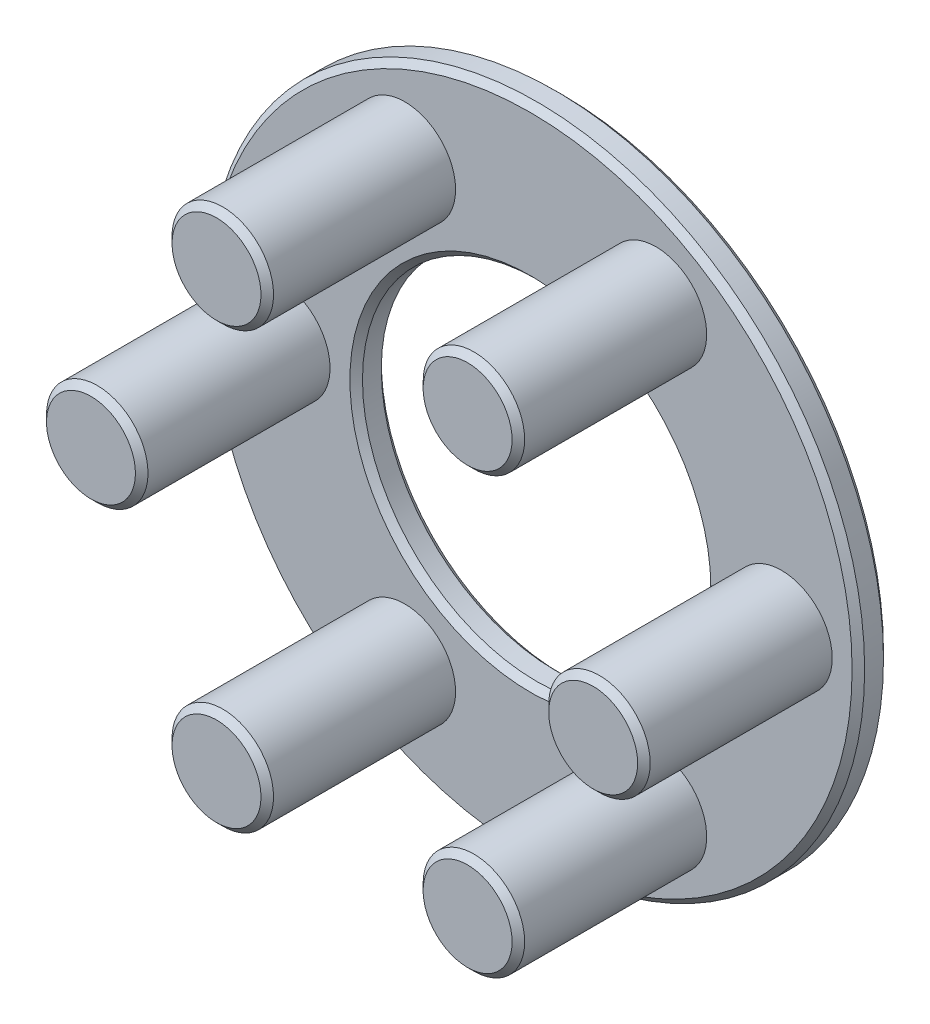
ISO-10303-21;
HEADER;
FILE_DESCRIPTION(('STEP AP214'),'2;1');
FILE_NAME('part.step','',(''),(''),'','','');
FILE_SCHEMA(('AUTOMOTIVE_DESIGN { 1 0 10303 214 1 1 1 1 }'));
ENDSEC;
DATA;
#1=APPLICATION_CONTEXT('core data for automotive mechanical design processes');
#2=APPLICATION_PROTOCOL_DEFINITION('international standard','automotive_design',2000,#1);
#3=PRODUCT_CONTEXT('',#1,'mechanical');
#4=PRODUCT('Part','Part','',(#3));
#5=PRODUCT_RELATED_PRODUCT_CATEGORY('part','',(#4));
#6=PRODUCT_DEFINITION_FORMATION('','',#4);
#7=PRODUCT_DEFINITION_CONTEXT('part definition',#1,'design');
#8=PRODUCT_DEFINITION('design','',#6,#7);
#9=PRODUCT_DEFINITION_SHAPE('','',#8);
#10=(LENGTH_UNIT() NAMED_UNIT(*) SI_UNIT(.MILLI.,.METRE.));
#11=(NAMED_UNIT(*) PLANE_ANGLE_UNIT() SI_UNIT($,.RADIAN.));
#12=(NAMED_UNIT(*) SI_UNIT($,.STERADIAN.) SOLID_ANGLE_UNIT());
#13=UNCERTAINTY_MEASURE_WITH_UNIT(LENGTH_MEASURE(1.E-05),#10,'distance_accuracy_value','');
#14=(GEOMETRIC_REPRESENTATION_CONTEXT(3) GLOBAL_UNCERTAINTY_ASSIGNED_CONTEXT((#13)) GLOBAL_UNIT_ASSIGNED_CONTEXT((#10,
#11,#12)) REPRESENTATION_CONTEXT('',''));
#15=CARTESIAN_POINT('',(0.,0.,0.));
#16=DIRECTION('',(0.,0.,1.));
#17=DIRECTION('',(1.,0.,0.));
#18=AXIS2_PLACEMENT_3D('',#15,#16,#17);
#19=CARTESIAN_POINT('',(0.,0.,-3.));
#20=DIRECTION('',(0.,0.,1.));
#21=DIRECTION('',(1.,0.,0.));
#22=AXIS2_PLACEMENT_3D('',#19,#20,#21);
#23=CYLINDRICAL_SURFACE('',#22,31.35);
#24=CARTESIAN_POINT('',(0.,0.,-2.39999999999999));
#25=DIRECTION('',(0.,0.,1.));
#26=DIRECTION('',(1.,0.,0.));
#27=AXIS2_PLACEMENT_3D('',#24,#25,#26);
#28=CIRCLE('',#27,31.35);
#29=CARTESIAN_POINT('',(31.35,0.,-2.39999999999999));
#30=VERTEX_POINT('',#29);
#31=EDGE_CURVE('E64',#30,#30,#28,.T.);
#32=ORIENTED_EDGE('',*,*,#31,.T.);
#33=EDGE_LOOP('',(#32));
#34=FACE_BOUND('',#33,.T.);
#35=CARTESIAN_POINT('',(0.,0.,-0.599999999999989));
#36=DIRECTION('',(0.,0.,1.));
#37=DIRECTION('',(1.,0.,0.));
#38=AXIS2_PLACEMENT_3D('',#35,#36,#37);
#39=CIRCLE('',#38,31.35);
#40=CARTESIAN_POINT('',(31.35,0.,-0.599999999999989));
#41=VERTEX_POINT('',#40);
#42=EDGE_CURVE('E67',#41,#41,#39,.F.);
#43=ORIENTED_EDGE('',*,*,#42,.T.);
#44=EDGE_LOOP('',(#43));
#45=FACE_BOUND('',#44,.T.);
#46=ADVANCED_FACE('F37',(#34,#45),#23,.T.);
#47=CARTESIAN_POINT('',(0.,0.,-3.));
#48=DIRECTION('',(0.,0.,1.));
#49=DIRECTION('',(1.,0.,0.));
#50=AXIS2_PLACEMENT_3D('',#47,#48,#49);
#51=PLANE('',#50);
#52=CARTESIAN_POINT('',(0.,0.,-3.));
#53=DIRECTION('',(0.,0.,1.));
#54=DIRECTION('',(1.,0.,0.));
#55=AXIS2_PLACEMENT_3D('',#52,#53,#54);
#56=CIRCLE('',#55,30.75);
#57=CARTESIAN_POINT('',(30.75,0.,-3.));
#58=VERTEX_POINT('',#57);
#59=EDGE_CURVE('E58',#58,#58,#56,.F.);
#60=ORIENTED_EDGE('',*,*,#59,.T.);
#61=EDGE_LOOP('',(#60));
#62=FACE_BOUND('',#61,.T.);
#63=CARTESIAN_POINT('',(0.,0.,-3.));
#64=DIRECTION('',(0.,0.,1.));
#65=DIRECTION('',(1.,0.,0.));
#66=AXIS2_PLACEMENT_3D('',#63,#64,#65);
#67=CIRCLE('',#66,17.25);
#68=CARTESIAN_POINT('',(17.25,0.,-3.));
#69=VERTEX_POINT('',#68);
#70=EDGE_CURVE('E61',#69,#69,#67,.T.);
#71=ORIENTED_EDGE('',*,*,#70,.T.);
#72=EDGE_LOOP('',(#71));
#73=FACE_BOUND('',#72,.T.);
#74=ADVANCED_FACE('F131',(#62,#73),#51,.F.);
#75=CARTESIAN_POINT('',(0.,0.,0.));
#76=DIRECTION('',(0.,0.,1.));
#77=DIRECTION('',(1.,0.,0.));
#78=AXIS2_PLACEMENT_3D('',#75,#76,#77);
#79=PLANE('',#78);
#80=CARTESIAN_POINT('',(0.,0.,0.));
#81=DIRECTION('',(0.,0.,1.));
#82=DIRECTION('',(1.,0.,0.));
#83=AXIS2_PLACEMENT_3D('',#80,#81,#82);
#84=CIRCLE('',#83,30.75);
#85=CARTESIAN_POINT('',(30.75,0.,0.));
#86=VERTEX_POINT('',#85);
#87=EDGE_CURVE('E49',#86,#86,#84,.T.);
#88=ORIENTED_EDGE('',*,*,#87,.T.);
#89=EDGE_LOOP('',(#88));
#90=FACE_BOUND('',#89,.T.);
#91=CARTESIAN_POINT('',(0.,0.,0.));
#92=DIRECTION('',(0.,0.,1.));
#93=DIRECTION('',(1.,0.,0.));
#94=AXIS2_PLACEMENT_3D('',#91,#92,#93);
#95=CIRCLE('',#94,17.25);
#96=CARTESIAN_POINT('',(17.25,0.,0.));
#97=VERTEX_POINT('',#96);
#98=EDGE_CURVE('E53',#97,#97,#95,.F.);
#99=ORIENTED_EDGE('',*,*,#98,.T.);
#100=EDGE_LOOP('',(#99));
#101=FACE_BOUND('',#100,.T.);
#102=CARTESIAN_POINT('',(12.0000000000002,20.7846096908264,0.));
#103=DIRECTION('',(0.,0.,1.));
#104=DIRECTION('',(0.50000000000001,0.866025403784433,0.));
#105=AXIS2_PLACEMENT_3D('',#102,#103,#104);
#106=CIRCLE('',#105,4.85);
#107=CARTESIAN_POINT('',(14.4250000000003,24.9848328991809,0.));
#108=VERTEX_POINT('',#107);
#109=EDGE_CURVE('E121',#108,#108,#106,.T.);
#110=ORIENTED_EDGE('',*,*,#109,.F.);
#111=EDGE_LOOP('',(#110));
#112=FACE_BOUND('',#111,.T.);
#113=CARTESIAN_POINT('',(-11.9999999999998,20.7846096908266,0.));
#114=DIRECTION('',(0.,0.,1.));
#115=DIRECTION('',(-0.499999999999992,0.866025403784443,0.));
#116=AXIS2_PLACEMENT_3D('',#113,#114,#115);
#117=CIRCLE('',#116,4.85);
#118=CARTESIAN_POINT('',(-14.4249999999998,24.9848328991812,0.));
#119=VERTEX_POINT('',#118);
#120=EDGE_CURVE('E118',#119,#119,#117,.T.);
#121=ORIENTED_EDGE('',*,*,#120,.F.);
#122=EDGE_LOOP('',(#121));
#123=FACE_BOUND('',#122,.T.);
#124=CARTESIAN_POINT('',(-24.,0.,0.));
#125=DIRECTION('',(0.,0.,1.));
#126=DIRECTION('',(-1.,0.,0.));
#127=AXIS2_PLACEMENT_3D('',#124,#125,#126);
#128=CIRCLE('',#127,4.85);
#129=CARTESIAN_POINT('',(-28.85,0.,0.));
#130=VERTEX_POINT('',#129);
#131=EDGE_CURVE('E115',#130,#130,#128,.T.);
#132=ORIENTED_EDGE('',*,*,#131,.F.);
#133=EDGE_LOOP('',(#132));
#134=FACE_BOUND('',#133,.T.);
#135=CARTESIAN_POINT('',(-12.0000000000001,-20.7846096908265,0.));
#136=DIRECTION('',(0.,0.,1.));
#137=DIRECTION('',(-0.500000000000004,-0.866025403784436,0.));
#138=AXIS2_PLACEMENT_3D('',#135,#136,#137);
#139=CIRCLE('',#138,4.85);
#140=CARTESIAN_POINT('',(-14.4250000000001,-24.984832899181,0.));
#141=VERTEX_POINT('',#140);
#142=EDGE_CURVE('E112',#141,#141,#139,.T.);
#143=ORIENTED_EDGE('',*,*,#142,.F.);
#144=EDGE_LOOP('',(#143));
#145=FACE_BOUND('',#144,.T.);
#146=CARTESIAN_POINT('',(12.,-20.7846096908266,0.));
#147=DIRECTION('',(0.,0.,1.));
#148=DIRECTION('',(0.499999999999998,-0.86602540378444,0.));
#149=AXIS2_PLACEMENT_3D('',#146,#147,#148);
#150=CIRCLE('',#149,4.85);
#151=CARTESIAN_POINT('',(14.4249999999999,-24.9848328991811,0.));
#152=VERTEX_POINT('',#151);
#153=EDGE_CURVE('E109',#152,#152,#150,.T.);
#154=ORIENTED_EDGE('',*,*,#153,.F.);
#155=EDGE_LOOP('',(#154));
#156=FACE_BOUND('',#155,.T.);
#157=CARTESIAN_POINT('',(24.,0.,0.));
#158=DIRECTION('',(0.,0.,1.));
#159=DIRECTION('',(1.,0.,0.));
#160=AXIS2_PLACEMENT_3D('',#157,#158,#159);
#161=CIRCLE('',#160,4.85);
#162=CARTESIAN_POINT('',(28.85,0.,0.));
#163=VERTEX_POINT('',#162);
#164=EDGE_CURVE('E106',#163,#163,#161,.T.);
#165=ORIENTED_EDGE('',*,*,#164,.F.);
#166=EDGE_LOOP('',(#165));
#167=FACE_BOUND('',#166,.T.);
#168=ADVANCED_FACE('F127',(#90,#101,#112,#123,#134,#145,#156,#167),#79,.T.);
#169=CARTESIAN_POINT('',(0.,0.,-3.));
#170=DIRECTION('',(0.,0.,1.));
#171=DIRECTION('',(1.,0.,0.));
#172=AXIS2_PLACEMENT_3D('',#169,#170,#171);
#173=CYLINDRICAL_SURFACE('',#172,16.65);
#174=CARTESIAN_POINT('',(0.,0.,-2.39999999999999));
#175=DIRECTION('',(0.,0.,1.));
#176=DIRECTION('',(1.,0.,0.));
#177=AXIS2_PLACEMENT_3D('',#174,#175,#176);
#178=CIRCLE('',#177,16.65);
#179=CARTESIAN_POINT('',(16.65,0.,-2.39999999999999));
#180=VERTEX_POINT('',#179);
#181=EDGE_CURVE('E10',#180,#180,#178,.F.);
#182=ORIENTED_EDGE('',*,*,#181,.T.);
#183=EDGE_LOOP('',(#182));
#184=FACE_BOUND('',#183,.T.);
#185=CARTESIAN_POINT('',(0.,0.,-0.599999999999993));
#186=DIRECTION('',(0.,0.,1.));
#187=DIRECTION('',(1.,0.,0.));
#188=AXIS2_PLACEMENT_3D('',#185,#186,#187);
#189=CIRCLE('',#188,16.65);
#190=CARTESIAN_POINT('',(16.65,0.,-0.599999999999993));
#191=VERTEX_POINT('',#190);
#192=EDGE_CURVE('E45',#191,#191,#189,.T.);
#193=ORIENTED_EDGE('',*,*,#192,.T.);
#194=EDGE_LOOP('',(#193));
#195=FACE_BOUND('',#194,.T.);
#196=ADVANCED_FACE('F130',(#184,#195),#173,.F.);
#197=CARTESIAN_POINT('',(24.,0.,18.));
#198=DIRECTION('',(0.,0.,-1.));
#199=DIRECTION('',(-1.,0.,0.));
#200=AXIS2_PLACEMENT_3D('',#197,#198,#199);
#201=CYLINDRICAL_SURFACE('',#200,4.85);
#202=CARTESIAN_POINT('',(24.,0.,17.4));
#203=DIRECTION('',(0.,0.,1.));
#204=DIRECTION('',(1.,0.,0.));
#205=AXIS2_PLACEMENT_3D('',#202,#203,#204);
#206=CIRCLE('',#205,4.85);
#207=CARTESIAN_POINT('',(28.85,0.,17.4));
#208=VERTEX_POINT('',#207);
#209=EDGE_CURVE('E88',#208,#208,#206,.F.);
#210=ORIENTED_EDGE('',*,*,#209,.T.);
#211=EDGE_LOOP('',(#210));
#212=FACE_BOUND('',#211,.T.);
#213=ORIENTED_EDGE('',*,*,#164,.T.);
#214=EDGE_LOOP('',(#213));
#215=FACE_BOUND('',#214,.T.);
#216=ADVANCED_FACE('F144',(#212,#215),#201,.T.);
#217=CARTESIAN_POINT('',(24.,0.,18.));
#218=DIRECTION('',(0.,0.,1.));
#219=DIRECTION('',(1.,0.,0.));
#220=AXIS2_PLACEMENT_3D('',#217,#218,#219);
#221=PLANE('',#220);
#222=CARTESIAN_POINT('',(24.,0.,18.));
#223=DIRECTION('',(0.,0.,1.));
#224=DIRECTION('',(1.,0.,0.));
#225=AXIS2_PLACEMENT_3D('',#222,#223,#224);
#226=CIRCLE('',#225,4.25);
#227=CARTESIAN_POINT('',(28.25,0.,18.));
#228=VERTEX_POINT('',#227);
#229=EDGE_CURVE('E91',#228,#228,#226,.T.);
#230=ORIENTED_EDGE('',*,*,#229,.T.);
#231=EDGE_LOOP('',(#230));
#232=FACE_BOUND('',#231,.T.);
#233=ADVANCED_FACE('F146',(#232),#221,.T.);
#234=CARTESIAN_POINT('',(12.,-20.7846096908266,18.));
#235=DIRECTION('',(0.,0.,-1.));
#236=DIRECTION('',(-1.,0.,0.));
#237=AXIS2_PLACEMENT_3D('',#234,#235,#236);
#238=CYLINDRICAL_SURFACE('',#237,4.85);
#239=CARTESIAN_POINT('',(12.,-20.7846096908266,17.4));
#240=DIRECTION('',(0.,0.,1.));
#241=DIRECTION('',(1.,0.,0.));
#242=AXIS2_PLACEMENT_3D('',#239,#240,#241);
#243=CIRCLE('',#242,4.85);
#244=CARTESIAN_POINT('',(16.8499999999999,-20.7846096908266,17.4));
#245=VERTEX_POINT('',#244);
#246=EDGE_CURVE('E94',#245,#245,#243,.F.);
#247=ORIENTED_EDGE('',*,*,#246,.T.);
#248=EDGE_LOOP('',(#247));
#249=FACE_BOUND('',#248,.T.);
#250=ORIENTED_EDGE('',*,*,#153,.T.);
#251=EDGE_LOOP('',(#250));
#252=FACE_BOUND('',#251,.T.);
#253=ADVANCED_FACE('F153',(#249,#252),#238,.T.);
#254=CARTESIAN_POINT('',(12.,-20.7846096908266,18.));
#255=DIRECTION('',(0.,0.,1.));
#256=DIRECTION('',(0.499999999999998,-0.86602540378444,0.));
#257=AXIS2_PLACEMENT_3D('',#254,#255,#256);
#258=PLANE('',#257);
#259=CARTESIAN_POINT('',(12.,-20.7846096908266,18.));
#260=DIRECTION('',(0.,0.,1.));
#261=DIRECTION('',(1.,0.,0.));
#262=AXIS2_PLACEMENT_3D('',#259,#260,#261);
#263=CIRCLE('',#262,4.25);
#264=CARTESIAN_POINT('',(16.25,-20.7846096908266,18.));
#265=VERTEX_POINT('',#264);
#266=EDGE_CURVE('E97',#265,#265,#263,.T.);
#267=ORIENTED_EDGE('',*,*,#266,.T.);
#268=EDGE_LOOP('',(#267));
#269=FACE_BOUND('',#268,.T.);
#270=ADVANCED_FACE('F388',(#269),#258,.T.);
#271=CARTESIAN_POINT('',(-12.0000000000001,-20.7846096908265,18.));
#272=DIRECTION('',(0.,0.,-1.));
#273=DIRECTION('',(-1.,0.,0.));
#274=AXIS2_PLACEMENT_3D('',#271,#272,#273);
#275=CYLINDRICAL_SURFACE('',#274,4.85);
#276=CARTESIAN_POINT('',(-12.0000000000001,-20.7846096908265,17.4));
#277=DIRECTION('',(0.,0.,1.));
#278=DIRECTION('',(1.,0.,0.));
#279=AXIS2_PLACEMENT_3D('',#276,#277,#278);
#280=CIRCLE('',#279,4.85);
#281=CARTESIAN_POINT('',(-7.1500000000001,-20.7846096908265,17.4));
#282=VERTEX_POINT('',#281);
#283=EDGE_CURVE('E100',#282,#282,#280,.F.);
#284=ORIENTED_EDGE('',*,*,#283,.T.);
#285=EDGE_LOOP('',(#284));
#286=FACE_BOUND('',#285,.T.);
#287=ORIENTED_EDGE('',*,*,#142,.T.);
#288=EDGE_LOOP('',(#287));
#289=FACE_BOUND('',#288,.T.);
#290=ADVANCED_FACE('F377',(#286,#289),#275,.T.);
#291=CARTESIAN_POINT('',(-12.0000000000001,-20.7846096908265,18.));
#292=DIRECTION('',(0.,0.,1.));
#293=DIRECTION('',(-0.500000000000004,-0.866025403784436,0.));
#294=AXIS2_PLACEMENT_3D('',#291,#292,#293);
#295=PLANE('',#294);
#296=CARTESIAN_POINT('',(-12.0000000000001,-20.7846096908265,18.));
#297=DIRECTION('',(0.,0.,1.));
#298=DIRECTION('',(1.,0.,0.));
#299=AXIS2_PLACEMENT_3D('',#296,#297,#298);
#300=CIRCLE('',#299,4.25000000000002);
#301=CARTESIAN_POINT('',(-7.75000000000008,-20.7846096908265,18.));
#302=VERTEX_POINT('',#301);
#303=EDGE_CURVE('E103',#302,#302,#300,.T.);
#304=ORIENTED_EDGE('',*,*,#303,.T.);
#305=EDGE_LOOP('',(#304));
#306=FACE_BOUND('',#305,.T.);
#307=ADVANCED_FACE('F366',(#306),#295,.T.);
#308=CARTESIAN_POINT('',(-24.,0.,18.));
#309=DIRECTION('',(0.,0.,-1.));
#310=DIRECTION('',(-1.,0.,0.));
#311=AXIS2_PLACEMENT_3D('',#308,#309,#310);
#312=CYLINDRICAL_SURFACE('',#311,4.85);
#313=CARTESIAN_POINT('',(-24.,0.,17.4));
#314=DIRECTION('',(0.,0.,1.));
#315=DIRECTION('',(1.,0.,0.));
#316=AXIS2_PLACEMENT_3D('',#313,#314,#315);
#317=CIRCLE('',#316,4.85);
#318=CARTESIAN_POINT('',(-19.15,0.,17.4));
#319=VERTEX_POINT('',#318);
#320=EDGE_CURVE('E76',#319,#319,#317,.F.);
#321=ORIENTED_EDGE('',*,*,#320,.T.);
#322=EDGE_LOOP('',(#321));
#323=FACE_BOUND('',#322,.T.);
#324=ORIENTED_EDGE('',*,*,#131,.T.);
#325=EDGE_LOOP('',(#324));
#326=FACE_BOUND('',#325,.T.);
#327=ADVANCED_FACE('F355',(#323,#326),#312,.T.);
#328=CARTESIAN_POINT('',(-24.,0.,18.));
#329=DIRECTION('',(0.,0.,1.));
#330=DIRECTION('',(-1.,0.,0.));
#331=AXIS2_PLACEMENT_3D('',#328,#329,#330);
#332=PLANE('',#331);
#333=CARTESIAN_POINT('',(-24.,0.,18.));
#334=DIRECTION('',(0.,0.,1.));
#335=DIRECTION('',(1.,0.,0.));
#336=AXIS2_PLACEMENT_3D('',#333,#334,#335);
#337=CIRCLE('',#336,4.25);
#338=CARTESIAN_POINT('',(-19.75,0.,18.));
#339=VERTEX_POINT('',#338);
#340=EDGE_CURVE('E79',#339,#339,#337,.T.);
#341=ORIENTED_EDGE('',*,*,#340,.T.);
#342=EDGE_LOOP('',(#341));
#343=FACE_BOUND('',#342,.T.);
#344=ADVANCED_FACE('F344',(#343),#332,.T.);
#345=CARTESIAN_POINT('',(-11.9999999999998,20.7846096908266,18.));
#346=DIRECTION('',(0.,0.,-1.));
#347=DIRECTION('',(-1.,0.,0.));
#348=AXIS2_PLACEMENT_3D('',#345,#346,#347);
#349=CYLINDRICAL_SURFACE('',#348,4.85);
#350=CARTESIAN_POINT('',(-11.9999999999998,20.7846096908266,17.4));
#351=DIRECTION('',(0.,0.,1.));
#352=DIRECTION('',(1.,0.,0.));
#353=AXIS2_PLACEMENT_3D('',#350,#351,#352);
#354=CIRCLE('',#353,4.85);
#355=CARTESIAN_POINT('',(-7.14999999999981,20.7846096908266,17.4));
#356=VERTEX_POINT('',#355);
#357=EDGE_CURVE('E70',#356,#356,#354,.F.);
#358=ORIENTED_EDGE('',*,*,#357,.T.);
#359=EDGE_LOOP('',(#358));
#360=FACE_BOUND('',#359,.T.);
#361=ORIENTED_EDGE('',*,*,#120,.T.);
#362=EDGE_LOOP('',(#361));
#363=FACE_BOUND('',#362,.T.);
#364=ADVANCED_FACE('F333',(#360,#363),#349,.T.);
#365=CARTESIAN_POINT('',(-11.9999999999998,20.7846096908266,18.));
#366=DIRECTION('',(0.,0.,1.));
#367=DIRECTION('',(-0.499999999999992,0.866025403784443,0.));
#368=AXIS2_PLACEMENT_3D('',#365,#366,#367);
#369=PLANE('',#368);
#370=CARTESIAN_POINT('',(-11.9999999999998,20.7846096908266,18.));
#371=DIRECTION('',(0.,0.,1.));
#372=DIRECTION('',(1.,0.,0.));
#373=AXIS2_PLACEMENT_3D('',#370,#371,#372);
#374=CIRCLE('',#373,4.25000000000001);
#375=CARTESIAN_POINT('',(-7.74999999999979,20.7846096908266,18.));
#376=VERTEX_POINT('',#375);
#377=EDGE_CURVE('E73',#376,#376,#374,.T.);
#378=ORIENTED_EDGE('',*,*,#377,.T.);
#379=EDGE_LOOP('',(#378));
#380=FACE_BOUND('',#379,.T.);
#381=ADVANCED_FACE('F322',(#380),#369,.T.);
#382=CARTESIAN_POINT('',(12.0000000000002,20.7846096908264,18.));
#383=DIRECTION('',(0.,0.,-1.));
#384=DIRECTION('',(-1.,0.,0.));
#385=AXIS2_PLACEMENT_3D('',#382,#383,#384);
#386=CYLINDRICAL_SURFACE('',#385,4.85);
#387=CARTESIAN_POINT('',(12.0000000000002,20.7846096908264,17.4));
#388=DIRECTION('',(0.,0.,1.));
#389=DIRECTION('',(1.,0.,0.));
#390=AXIS2_PLACEMENT_3D('',#387,#388,#389);
#391=CIRCLE('',#390,4.85);
#392=CARTESIAN_POINT('',(16.8500000000002,20.7846096908264,17.4));
#393=VERTEX_POINT('',#392);
#394=EDGE_CURVE('E82',#393,#393,#391,.F.);
#395=ORIENTED_EDGE('',*,*,#394,.T.);
#396=EDGE_LOOP('',(#395));
#397=FACE_BOUND('',#396,.T.);
#398=ORIENTED_EDGE('',*,*,#109,.T.);
#399=EDGE_LOOP('',(#398));
#400=FACE_BOUND('',#399,.T.);
#401=ADVANCED_FACE('F125',(#397,#400),#386,.T.);
#402=CARTESIAN_POINT('',(12.0000000000002,20.7846096908264,18.));
#403=DIRECTION('',(0.,0.,1.));
#404=DIRECTION('',(0.50000000000001,0.866025403784433,0.));
#405=AXIS2_PLACEMENT_3D('',#402,#403,#404);
#406=PLANE('',#405);
#407=CARTESIAN_POINT('',(12.0000000000002,20.7846096908264,18.));
#408=DIRECTION('',(0.,0.,1.));
#409=DIRECTION('',(1.,0.,0.));
#410=AXIS2_PLACEMENT_3D('',#407,#408,#409);
#411=CIRCLE('',#410,4.24999999999999);
#412=CARTESIAN_POINT('',(16.2500000000002,20.7846096908264,18.));
#413=VERTEX_POINT('',#412);
#414=EDGE_CURVE('E85',#413,#413,#411,.T.);
#415=ORIENTED_EDGE('',*,*,#414,.T.);
#416=EDGE_LOOP('',(#415));
#417=FACE_BOUND('',#416,.T.);
#418=ADVANCED_FACE('F175',(#417),#406,.T.);
#419=CARTESIAN_POINT('',(-12.0000000000001,-20.7846096908265,18.));
#420=DIRECTION('',(0.,0.,-1.));
#421=DIRECTION('',(-1.,0.,0.));
#422=AXIS2_PLACEMENT_3D('',#419,#420,#421);
#423=CONICAL_SURFACE('',#422,4.25000000000002,0.785398163397436);
#424=ORIENTED_EDGE('',*,*,#283,.F.);
#425=EDGE_LOOP('',(#424));
#426=FACE_BOUND('',#425,.T.);
#427=ORIENTED_EDGE('',*,*,#303,.F.);
#428=EDGE_LOOP('',(#427));
#429=FACE_BOUND('',#428,.T.);
#430=ADVANCED_FACE('F168',(#426,#429),#423,.T.);
#431=CARTESIAN_POINT('',(12.,-20.7846096908266,18.));
#432=DIRECTION('',(0.,0.,-1.));
#433=DIRECTION('',(-1.,0.,0.));
#434=AXIS2_PLACEMENT_3D('',#431,#432,#433);
#435=CONICAL_SURFACE('',#434,4.25,0.78539816339745);
#436=ORIENTED_EDGE('',*,*,#246,.F.);
#437=EDGE_LOOP('',(#436));
#438=FACE_BOUND('',#437,.T.);
#439=ORIENTED_EDGE('',*,*,#266,.F.);
#440=EDGE_LOOP('',(#439));
#441=FACE_BOUND('',#440,.T.);
#442=ADVANCED_FACE('F174',(#438,#441),#435,.T.);
#443=CARTESIAN_POINT('',(24.,0.,18.));
#444=DIRECTION('',(0.,0.,-1.));
#445=DIRECTION('',(-1.,0.,0.));
#446=AXIS2_PLACEMENT_3D('',#443,#444,#445);
#447=CONICAL_SURFACE('',#446,4.25,0.78539816339745);
#448=ORIENTED_EDGE('',*,*,#209,.F.);
#449=EDGE_LOOP('',(#448));
#450=FACE_BOUND('',#449,.T.);
#451=ORIENTED_EDGE('',*,*,#229,.F.);
#452=EDGE_LOOP('',(#451));
#453=FACE_BOUND('',#452,.T.);
#454=ADVANCED_FACE('F182',(#450,#453),#447,.T.);
#455=CARTESIAN_POINT('',(12.0000000000002,20.7846096908264,18.));
#456=DIRECTION('',(0.,0.,-1.));
#457=DIRECTION('',(-1.,0.,0.));
#458=AXIS2_PLACEMENT_3D('',#455,#456,#457);
#459=CONICAL_SURFACE('',#458,4.24999999999999,0.785398163397448);
#460=ORIENTED_EDGE('',*,*,#394,.F.);
#461=EDGE_LOOP('',(#460));
#462=FACE_BOUND('',#461,.T.);
#463=ORIENTED_EDGE('',*,*,#414,.F.);
#464=EDGE_LOOP('',(#463));
#465=FACE_BOUND('',#464,.T.);
#466=ADVANCED_FACE('F189',(#462,#465),#459,.T.);
#467=CARTESIAN_POINT('',(-24.,0.,18.));
#468=DIRECTION('',(0.,0.,-1.));
#469=DIRECTION('',(-1.,0.,0.));
#470=AXIS2_PLACEMENT_3D('',#467,#468,#469);
#471=CONICAL_SURFACE('',#470,4.25,0.78539816339745);
#472=ORIENTED_EDGE('',*,*,#320,.F.);
#473=EDGE_LOOP('',(#472));
#474=FACE_BOUND('',#473,.T.);
#475=ORIENTED_EDGE('',*,*,#340,.F.);
#476=EDGE_LOOP('',(#475));
#477=FACE_BOUND('',#476,.T.);
#478=ADVANCED_FACE('F196',(#474,#477),#471,.T.);
#479=CARTESIAN_POINT('',(-11.9999999999998,20.7846096908266,18.));
#480=DIRECTION('',(0.,0.,-1.));
#481=DIRECTION('',(-1.,0.,0.));
#482=AXIS2_PLACEMENT_3D('',#479,#480,#481);
#483=CONICAL_SURFACE('',#482,4.25000000000001,0.785398163397438);
#484=ORIENTED_EDGE('',*,*,#357,.F.);
#485=EDGE_LOOP('',(#484));
#486=FACE_BOUND('',#485,.T.);
#487=ORIENTED_EDGE('',*,*,#377,.F.);
#488=EDGE_LOOP('',(#487));
#489=FACE_BOUND('',#488,.T.);
#490=ADVANCED_FACE('F203',(#486,#489),#483,.T.);
#491=CARTESIAN_POINT('',(0.,0.,-2.39999999999999));
#492=DIRECTION('',(0.,0.,1.));
#493=DIRECTION('',(1.,0.,0.));
#494=AXIS2_PLACEMENT_3D('',#491,#492,#493);
#495=CONICAL_SURFACE('',#494,31.35,0.785398163397454);
#496=ORIENTED_EDGE('',*,*,#59,.F.);
#497=EDGE_LOOP('',(#496));
#498=FACE_BOUND('',#497,.T.);
#499=ORIENTED_EDGE('',*,*,#31,.F.);
#500=EDGE_LOOP('',(#499));
#501=FACE_BOUND('',#500,.T.);
#502=ADVANCED_FACE('F210',(#498,#501),#495,.T.);
#503=CARTESIAN_POINT('',(0.,0.,0.));
#504=DIRECTION('',(0.,0.,-1.));
#505=DIRECTION('',(-1.,0.,0.));
#506=AXIS2_PLACEMENT_3D('',#503,#504,#505);
#507=CONICAL_SURFACE('',#506,30.75,0.785398163397448);
#508=ORIENTED_EDGE('',*,*,#42,.F.);
#509=EDGE_LOOP('',(#508));
#510=FACE_BOUND('',#509,.T.);
#511=ORIENTED_EDGE('',*,*,#87,.F.);
#512=EDGE_LOOP('',(#511));
#513=FACE_BOUND('',#512,.T.);
#514=ADVANCED_FACE('F217',(#510,#513),#507,.T.);
#515=CARTESIAN_POINT('',(0.,0.,-3.));
#516=DIRECTION('',(0.,0.,-1.));
#517=DIRECTION('',(-1.,0.,0.));
#518=AXIS2_PLACEMENT_3D('',#515,#516,#517);
#519=CONICAL_SURFACE('',#518,17.25,0.785398163397445);
#520=ORIENTED_EDGE('',*,*,#181,.F.);
#521=EDGE_LOOP('',(#520));
#522=FACE_BOUND('',#521,.T.);
#523=ORIENTED_EDGE('',*,*,#70,.F.);
#524=EDGE_LOOP('',(#523));
#525=FACE_BOUND('',#524,.T.);
#526=ADVANCED_FACE('F223',(#522,#525),#519,.F.);
#527=CARTESIAN_POINT('',(0.,0.,-0.599999999999993));
#528=DIRECTION('',(0.,0.,1.));
#529=DIRECTION('',(1.,0.,0.));
#530=AXIS2_PLACEMENT_3D('',#527,#528,#529);
#531=CONICAL_SURFACE('',#530,16.65,0.785398163397445);
#532=ORIENTED_EDGE('',*,*,#98,.F.);
#533=EDGE_LOOP('',(#532));
#534=FACE_BOUND('',#533,.T.);
#535=ORIENTED_EDGE('',*,*,#192,.F.);
#536=EDGE_LOOP('',(#535));
#537=FACE_BOUND('',#536,.T.);
#538=ADVANCED_FACE('F40',(#534,#537),#531,.F.);
#539=CLOSED_SHELL('',(#46,#74,#168,#196,#216,#233,#253,#270,#290,#307,#327,#344,#364,#381,#401,
#418,#430,#442,#454,#466,#478,#490,#502,#514,#526,#538));
#540=MANIFOLD_SOLID_BREP('B2',#539);
#541=ADVANCED_BREP_SHAPE_REPRESENTATION('',(#18,#540),#14);
#542=SHAPE_DEFINITION_REPRESENTATION(#9,#541);
ENDSEC;
END-ISO-10303-21;
